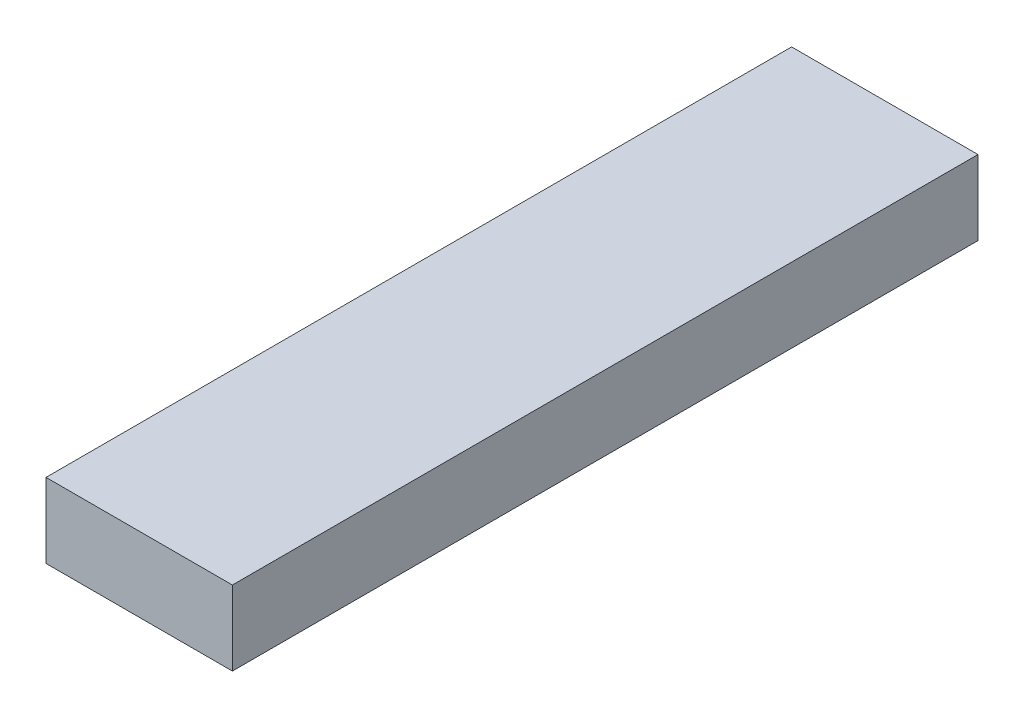
ISO-10303-21;
HEADER;
FILE_DESCRIPTION(('STEP AP214'),'2;1');
FILE_NAME('part.step','',(''),(''),'','','');
FILE_SCHEMA(('AUTOMOTIVE_DESIGN { 1 0 10303 214 1 1 1 1 }'));
ENDSEC;
DATA;
#1=APPLICATION_CONTEXT('core data for automotive mechanical design processes');
#2=APPLICATION_PROTOCOL_DEFINITION('international standard','automotive_design',2000,#1);
#3=PRODUCT_CONTEXT('',#1,'mechanical');
#4=PRODUCT('Part','Part','',(#3));
#5=PRODUCT_RELATED_PRODUCT_CATEGORY('part','',(#4));
#6=PRODUCT_DEFINITION_FORMATION('','',#4);
#7=PRODUCT_DEFINITION_CONTEXT('part definition',#1,'design');
#8=PRODUCT_DEFINITION('design','',#6,#7);
#9=PRODUCT_DEFINITION_SHAPE('','',#8);
#10=(LENGTH_UNIT() NAMED_UNIT(*) SI_UNIT(.MILLI.,.METRE.));
#11=(NAMED_UNIT(*) PLANE_ANGLE_UNIT() SI_UNIT($,.RADIAN.));
#12=(NAMED_UNIT(*) SI_UNIT($,.STERADIAN.) SOLID_ANGLE_UNIT());
#13=UNCERTAINTY_MEASURE_WITH_UNIT(LENGTH_MEASURE(1.E-05),#10,'distance_accuracy_value','');
#14=(GEOMETRIC_REPRESENTATION_CONTEXT(3) GLOBAL_UNCERTAINTY_ASSIGNED_CONTEXT((#13)) GLOBAL_UNIT_ASSIGNED_CONTEXT((#10,
#11,#12)) REPRESENTATION_CONTEXT('',''));
#15=CARTESIAN_POINT('',(0.,0.,0.));
#16=DIRECTION('',(0.,0.,1.));
#17=DIRECTION('',(1.,0.,0.));
#18=AXIS2_PLACEMENT_3D('',#15,#16,#17);
#19=CARTESIAN_POINT('',(0.,0.,2.));
#20=DIRECTION('',(1.,0.,0.));
#21=DIRECTION('',(0.,0.,-1.));
#22=AXIS2_PLACEMENT_3D('',#19,#20,#21);
#23=PLANE('',#22);
#24=DIRECTION('',(0.,-1.,0.));
#25=VECTOR('',#24,1.);
#26=CARTESIAN_POINT('',(0.,0.,0.));
#27=LINE('',#26,#25);
#28=CARTESIAN_POINT('',(0.,0.200000000000001,0.));
#29=VERTEX_POINT('',#28);
#30=CARTESIAN_POINT('',(0.,0.,0.));
#31=VERTEX_POINT('',#30);
#32=EDGE_CURVE('E97',#29,#31,#27,.T.);
#33=ORIENTED_EDGE('',*,*,#32,.T.);
#34=DIRECTION('',(0.,0.,-1.));
#35=VECTOR('',#34,1.);
#36=CARTESIAN_POINT('',(0.,0.,2.));
#37=LINE('',#36,#35);
#38=CARTESIAN_POINT('',(0.,0.,2.));
#39=VERTEX_POINT('',#38);
#40=EDGE_CURVE('E11',#39,#31,#37,.T.);
#41=ORIENTED_EDGE('',*,*,#40,.F.);
#42=DIRECTION('',(0.,-1.,0.));
#43=VECTOR('',#42,1.);
#44=CARTESIAN_POINT('',(0.,0.,2.));
#45=LINE('',#44,#43);
#46=CARTESIAN_POINT('',(0.,0.200000000000001,2.));
#47=VERTEX_POINT('',#46);
#48=EDGE_CURVE('E85',#47,#39,#45,.T.);
#49=ORIENTED_EDGE('',*,*,#48,.F.);
#50=DIRECTION('',(0.,0.,-1.));
#51=VECTOR('',#50,1.);
#52=CARTESIAN_POINT('',(0.,0.200000000000001,2.));
#53=LINE('',#52,#51);
#54=EDGE_CURVE('E93',#47,#29,#53,.T.);
#55=ORIENTED_EDGE('',*,*,#54,.T.);
#56=EDGE_LOOP('',(#33,#41,#49,#55));
#57=FACE_BOUND('',#56,.T.);
#58=ADVANCED_FACE('F34',(#57),#23,.F.);
#59=CARTESIAN_POINT('',(0.,0.,2.));
#60=DIRECTION('',(0.,1.,0.));
#61=DIRECTION('',(0.,0.,1.));
#62=AXIS2_PLACEMENT_3D('',#59,#60,#61);
#63=PLANE('',#62);
#64=DIRECTION('',(1.,0.,0.));
#65=VECTOR('',#64,1.);
#66=CARTESIAN_POINT('',(0.,0.,0.));
#67=LINE('',#66,#65);
#68=CARTESIAN_POINT('',(0.5,0.,0.));
#69=VERTEX_POINT('',#68);
#70=EDGE_CURVE('E89',#31,#69,#67,.T.);
#71=ORIENTED_EDGE('',*,*,#70,.T.);
#72=DIRECTION('',(0.,0.,-1.));
#73=VECTOR('',#72,1.);
#74=CARTESIAN_POINT('',(0.5,0.,2.));
#75=LINE('',#74,#73);
#76=CARTESIAN_POINT('',(0.5,0.,2.));
#77=VERTEX_POINT('',#76);
#78=EDGE_CURVE('E42',#77,#69,#75,.T.);
#79=ORIENTED_EDGE('',*,*,#78,.F.);
#80=DIRECTION('',(1.,0.,0.));
#81=VECTOR('',#80,1.);
#82=CARTESIAN_POINT('',(0.,0.,2.));
#83=LINE('',#82,#81);
#84=EDGE_CURVE('E80',#39,#77,#83,.T.);
#85=ORIENTED_EDGE('',*,*,#84,.F.);
#86=ORIENTED_EDGE('',*,*,#40,.T.);
#87=EDGE_LOOP('',(#71,#79,#85,#86));
#88=FACE_BOUND('',#87,.T.);
#89=ADVANCED_FACE('F88',(#88),#63,.F.);
#90=CARTESIAN_POINT('',(0.5,0.,2.));
#91=DIRECTION('',(-1.,0.,0.));
#92=DIRECTION('',(0.,0.,1.));
#93=AXIS2_PLACEMENT_3D('',#90,#91,#92);
#94=PLANE('',#93);
#95=DIRECTION('',(0.,1.,0.));
#96=VECTOR('',#95,1.);
#97=CARTESIAN_POINT('',(0.5,0.,0.));
#98=LINE('',#97,#96);
#99=CARTESIAN_POINT('',(0.5,0.2,0.));
#100=VERTEX_POINT('',#99);
#101=EDGE_CURVE('E67',#69,#100,#98,.T.);
#102=ORIENTED_EDGE('',*,*,#101,.T.);
#103=DIRECTION('',(0.,0.,-1.));
#104=VECTOR('',#103,1.);
#105=CARTESIAN_POINT('',(0.5,0.2,2.));
#106=LINE('',#105,#104);
#107=CARTESIAN_POINT('',(0.5,0.2,2.));
#108=VERTEX_POINT('',#107);
#109=EDGE_CURVE('E90',#108,#100,#106,.T.);
#110=ORIENTED_EDGE('',*,*,#109,.F.);
#111=DIRECTION('',(0.,1.,0.));
#112=VECTOR('',#111,1.);
#113=CARTESIAN_POINT('',(0.5,0.,2.));
#114=LINE('',#113,#112);
#115=EDGE_CURVE('E83',#77,#108,#114,.T.);
#116=ORIENTED_EDGE('',*,*,#115,.F.);
#117=ORIENTED_EDGE('',*,*,#78,.T.);
#118=EDGE_LOOP('',(#102,#110,#116,#117));
#119=FACE_BOUND('',#118,.T.);
#120=ADVANCED_FACE('F91',(#119),#94,.F.);
#121=CARTESIAN_POINT('',(0.,0.200000000000001,2.));
#122=DIRECTION('',(0.,-1.,0.));
#123=DIRECTION('',(1.,0.,0.));
#124=AXIS2_PLACEMENT_3D('',#121,#122,#123);
#125=PLANE('',#124);
#126=DIRECTION('',(-1.,0.,0.));
#127=VECTOR('',#126,1.);
#128=CARTESIAN_POINT('',(0.,0.200000000000001,0.));
#129=LINE('',#128,#127);
#130=EDGE_CURVE('E73',#100,#29,#129,.T.);
#131=ORIENTED_EDGE('',*,*,#130,.T.);
#132=ORIENTED_EDGE('',*,*,#54,.F.);
#133=DIRECTION('',(-1.,0.,0.));
#134=VECTOR('',#133,1.);
#135=CARTESIAN_POINT('',(0.,0.200000000000001,2.));
#136=LINE('',#135,#134);
#137=EDGE_CURVE('E50',#108,#47,#136,.T.);
#138=ORIENTED_EDGE('',*,*,#137,.F.);
#139=ORIENTED_EDGE('',*,*,#109,.T.);
#140=EDGE_LOOP('',(#131,#132,#138,#139));
#141=FACE_BOUND('',#140,.T.);
#142=ADVANCED_FACE('F104',(#141),#125,.F.);
#143=CARTESIAN_POINT('',(0.,0.200000000000001,2.));
#144=DIRECTION('',(0.,0.,-1.));
#145=DIRECTION('',(-1.,0.,0.));
#146=AXIS2_PLACEMENT_3D('',#143,#144,#145);
#147=PLANE('',#146);
#148=ORIENTED_EDGE('',*,*,#48,.T.);
#149=ORIENTED_EDGE('',*,*,#84,.T.);
#150=ORIENTED_EDGE('',*,*,#115,.T.);
#151=ORIENTED_EDGE('',*,*,#137,.T.);
#152=EDGE_LOOP('',(#148,#149,#150,#151));
#153=FACE_BOUND('',#152,.T.);
#154=ADVANCED_FACE('F81',(#153),#147,.F.);
#155=CARTESIAN_POINT('',(0.,0.200000000000001,0.));
#156=DIRECTION('',(0.,0.,-1.));
#157=DIRECTION('',(-1.,0.,0.));
#158=AXIS2_PLACEMENT_3D('',#155,#156,#157);
#159=PLANE('',#158);
#160=ORIENTED_EDGE('',*,*,#32,.F.);
#161=ORIENTED_EDGE('',*,*,#130,.F.);
#162=ORIENTED_EDGE('',*,*,#101,.F.);
#163=ORIENTED_EDGE('',*,*,#70,.F.);
#164=EDGE_LOOP('',(#160,#161,#162,#163));
#165=FACE_BOUND('',#164,.T.);
#166=ADVANCED_FACE('F107',(#165),#159,.T.);
#167=CLOSED_SHELL('',(#58,#89,#120,#142,#154,#166));
#168=MANIFOLD_SOLID_BREP('B2',#167);
#169=ADVANCED_BREP_SHAPE_REPRESENTATION('',(#18,#168),#14);
#170=SHAPE_DEFINITION_REPRESENTATION(#9,#169);
ENDSEC;
END-ISO-10303-21;
